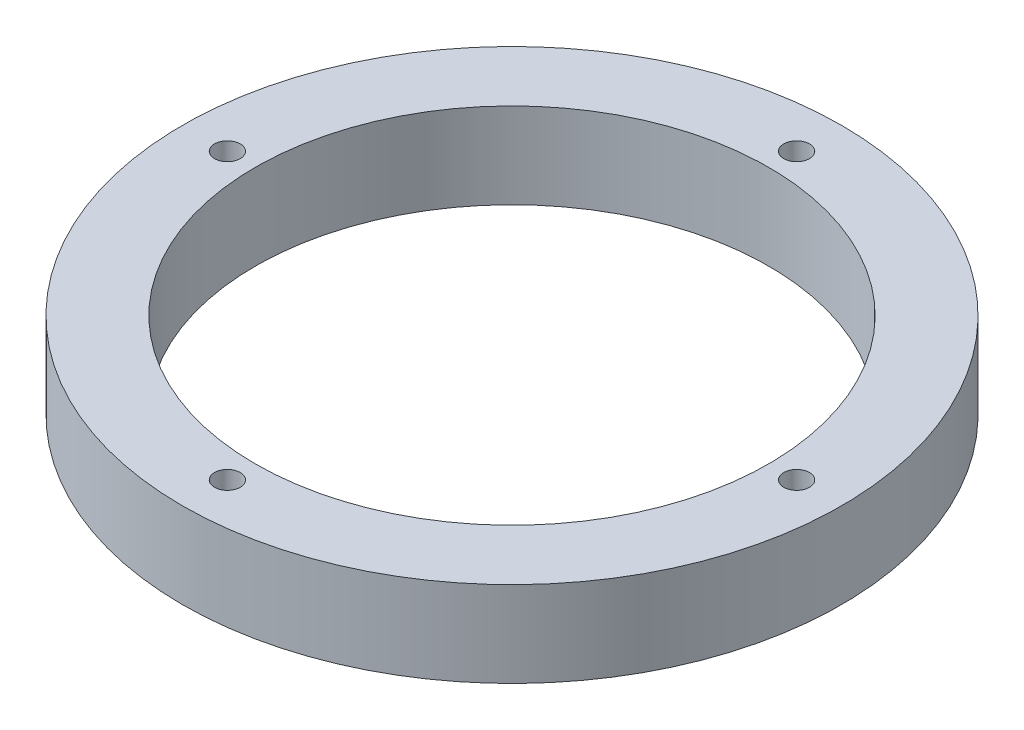
ISO-10303-21;
HEADER;
FILE_DESCRIPTION(('STEP AP214'),'2;1');
FILE_NAME('part.step','',(''),(''),'','','');
FILE_SCHEMA(('AUTOMOTIVE_DESIGN { 1 0 10303 214 1 1 1 1 }'));
ENDSEC;
DATA;
#1=APPLICATION_CONTEXT('core data for automotive mechanical design processes');
#2=APPLICATION_PROTOCOL_DEFINITION('international standard','automotive_design',2000,#1);
#3=PRODUCT_CONTEXT('',#1,'mechanical');
#4=PRODUCT('Part','Part','',(#3));
#5=PRODUCT_RELATED_PRODUCT_CATEGORY('part','',(#4));
#6=PRODUCT_DEFINITION_FORMATION('','',#4);
#7=PRODUCT_DEFINITION_CONTEXT('part definition',#1,'design');
#8=PRODUCT_DEFINITION('design','',#6,#7);
#9=PRODUCT_DEFINITION_SHAPE('','',#8);
#10=(LENGTH_UNIT() NAMED_UNIT(*) SI_UNIT(.MILLI.,.METRE.));
#11=(NAMED_UNIT(*) PLANE_ANGLE_UNIT() SI_UNIT($,.RADIAN.));
#12=(NAMED_UNIT(*) SI_UNIT($,.STERADIAN.) SOLID_ANGLE_UNIT());
#13=UNCERTAINTY_MEASURE_WITH_UNIT(LENGTH_MEASURE(1.E-05),#10,'distance_accuracy_value','');
#14=(GEOMETRIC_REPRESENTATION_CONTEXT(3) GLOBAL_UNCERTAINTY_ASSIGNED_CONTEXT((#13)) GLOBAL_UNIT_ASSIGNED_CONTEXT((#10,
#11,#12)) REPRESENTATION_CONTEXT('',''));
#15=CARTESIAN_POINT('',(0.,0.,0.));
#16=DIRECTION('',(0.,0.,1.));
#17=DIRECTION('',(1.,0.,0.));
#18=AXIS2_PLACEMENT_3D('',#15,#16,#17);
#19=CARTESIAN_POINT('',(0.,12.7,0.));
#20=DIRECTION('',(0.,1.,0.));
#21=DIRECTION('',(0.,0.,1.));
#22=AXIS2_PLACEMENT_3D('',#19,#20,#21);
#23=PLANE('',#22);
#24=CARTESIAN_POINT('',(1.32583864945278E-12,12.7,42.2275));
#25=DIRECTION('',(0.,1.,0.));
#26=DIRECTION('',(0.,0.,1.));
#27=AXIS2_PLACEMENT_3D('',#24,#25,#26);
#28=CIRCLE('',#27,1.905);
#29=CARTESIAN_POINT('',(1.32583864945278E-12,12.7,44.1325));
#30=VERTEX_POINT('',#29);
#31=EDGE_CURVE('E60',#30,#30,#28,.T.);
#32=ORIENTED_EDGE('',*,*,#31,.F.);
#33=EDGE_LOOP('',(#32));
#34=FACE_BOUND('',#33,.T.);
#35=CARTESIAN_POINT('',(0.,12.7,-42.2275));
#36=DIRECTION('',(0.,1.,0.));
#37=DIRECTION('',(0.,0.,1.));
#38=AXIS2_PLACEMENT_3D('',#35,#36,#37);
#39=CIRCLE('',#38,1.905);
#40=CARTESIAN_POINT('',(0.,12.7,-40.3225));
#41=VERTEX_POINT('',#40);
#42=EDGE_CURVE('E48',#41,#41,#39,.T.);
#43=ORIENTED_EDGE('',*,*,#42,.F.);
#44=EDGE_LOOP('',(#43));
#45=FACE_BOUND('',#44,.T.);
#46=CARTESIAN_POINT('',(0.,12.7,0.));
#47=DIRECTION('',(0.,1.,0.));
#48=DIRECTION('',(0.,0.,1.));
#49=AXIS2_PLACEMENT_3D('',#46,#47,#48);
#50=CIRCLE('',#49,48.895);
#51=CARTESIAN_POINT('',(0.,12.7,48.895));
#52=VERTEX_POINT('',#51);
#53=EDGE_CURVE('E10',#52,#52,#50,.T.);
#54=ORIENTED_EDGE('',*,*,#53,.T.);
#55=EDGE_LOOP('',(#54));
#56=FACE_BOUND('',#55,.T.);
#57=CARTESIAN_POINT('',(0.,12.7,0.));
#58=DIRECTION('',(0.,1.,0.));
#59=DIRECTION('',(0.,0.,1.));
#60=AXIS2_PLACEMENT_3D('',#57,#58,#59);
#61=CIRCLE('',#60,38.1);
#62=CARTESIAN_POINT('',(0.,12.7,38.1));
#63=VERTEX_POINT('',#62);
#64=EDGE_CURVE('E43',#63,#63,#61,.T.);
#65=ORIENTED_EDGE('',*,*,#64,.F.);
#66=EDGE_LOOP('',(#65));
#67=FACE_BOUND('',#66,.T.);
#68=CARTESIAN_POINT('',(42.2275000000007,12.7,-6.62919324726392E-13));
#69=DIRECTION('',(0.,1.,0.));
#70=DIRECTION('',(0.,0.,1.));
#71=AXIS2_PLACEMENT_3D('',#68,#69,#70);
#72=CIRCLE('',#71,1.905);
#73=CARTESIAN_POINT('',(42.2275000000007,12.7,1.90499999999934));
#74=VERTEX_POINT('',#73);
#75=EDGE_CURVE('E54',#74,#74,#72,.T.);
#76=ORIENTED_EDGE('',*,*,#75,.F.);
#77=EDGE_LOOP('',(#76));
#78=FACE_BOUND('',#77,.T.);
#79=CARTESIAN_POINT('',(-42.2274999999993,12.7,6.68090701997492E-13));
#80=DIRECTION('',(0.,1.,0.));
#81=DIRECTION('',(0.,0.,1.));
#82=AXIS2_PLACEMENT_3D('',#79,#80,#81);
#83=CIRCLE('',#82,1.905);
#84=CARTESIAN_POINT('',(-42.2274999999993,12.7,1.90500000000067));
#85=VERTEX_POINT('',#84);
#86=EDGE_CURVE('E66',#85,#85,#83,.T.);
#87=ORIENTED_EDGE('',*,*,#86,.F.);
#88=EDGE_LOOP('',(#87));
#89=FACE_BOUND('',#88,.T.);
#90=ADVANCED_FACE('F32',(#34,#45,#56,#67,#78,#89),#23,.T.);
#91=CARTESIAN_POINT('',(0.,0.,0.));
#92=DIRECTION('',(0.,1.,0.));
#93=DIRECTION('',(0.,0.,1.));
#94=AXIS2_PLACEMENT_3D('',#91,#92,#93);
#95=PLANE('',#94);
#96=CARTESIAN_POINT('',(0.,0.,0.));
#97=DIRECTION('',(0.,1.,0.));
#98=DIRECTION('',(0.,0.,1.));
#99=AXIS2_PLACEMENT_3D('',#96,#97,#98);
#100=CIRCLE('',#99,48.895);
#101=CARTESIAN_POINT('',(0.,0.,48.895));
#102=VERTEX_POINT('',#101);
#103=EDGE_CURVE('E36',#102,#102,#100,.T.);
#104=ORIENTED_EDGE('',*,*,#103,.F.);
#105=EDGE_LOOP('',(#104));
#106=FACE_BOUND('',#105,.T.);
#107=CARTESIAN_POINT('',(0.,0.,0.));
#108=DIRECTION('',(0.,1.,0.));
#109=DIRECTION('',(0.,0.,1.));
#110=AXIS2_PLACEMENT_3D('',#107,#108,#109);
#111=CIRCLE('',#110,38.1);
#112=CARTESIAN_POINT('',(0.,0.,38.1));
#113=VERTEX_POINT('',#112);
#114=EDGE_CURVE('E45',#113,#113,#111,.T.);
#115=ORIENTED_EDGE('',*,*,#114,.T.);
#116=EDGE_LOOP('',(#115));
#117=FACE_BOUND('',#116,.T.);
#118=CARTESIAN_POINT('',(0.,0.,-42.2275));
#119=DIRECTION('',(0.,1.,0.));
#120=DIRECTION('',(0.,0.,1.));
#121=AXIS2_PLACEMENT_3D('',#118,#119,#120);
#122=CIRCLE('',#121,1.905);
#123=CARTESIAN_POINT('',(0.,0.,-40.3225));
#124=VERTEX_POINT('',#123);
#125=EDGE_CURVE('E51',#124,#124,#122,.T.);
#126=ORIENTED_EDGE('',*,*,#125,.T.);
#127=EDGE_LOOP('',(#126));
#128=FACE_BOUND('',#127,.T.);
#129=CARTESIAN_POINT('',(42.2275000000007,0.,-6.62919324726392E-13));
#130=DIRECTION('',(0.,1.,0.));
#131=DIRECTION('',(0.,0.,1.));
#132=AXIS2_PLACEMENT_3D('',#129,#130,#131);
#133=CIRCLE('',#132,1.905);
#134=CARTESIAN_POINT('',(42.2275000000007,0.,1.90499999999934));
#135=VERTEX_POINT('',#134);
#136=EDGE_CURVE('E57',#135,#135,#133,.T.);
#137=ORIENTED_EDGE('',*,*,#136,.T.);
#138=EDGE_LOOP('',(#137));
#139=FACE_BOUND('',#138,.T.);
#140=CARTESIAN_POINT('',(1.32583864945278E-12,0.,42.2275));
#141=DIRECTION('',(0.,1.,0.));
#142=DIRECTION('',(0.,0.,1.));
#143=AXIS2_PLACEMENT_3D('',#140,#141,#142);
#144=CIRCLE('',#143,1.905);
#145=CARTESIAN_POINT('',(1.32583864945278E-12,0.,44.1325));
#146=VERTEX_POINT('',#145);
#147=EDGE_CURVE('E63',#146,#146,#144,.T.);
#148=ORIENTED_EDGE('',*,*,#147,.T.);
#149=EDGE_LOOP('',(#148));
#150=FACE_BOUND('',#149,.T.);
#151=CARTESIAN_POINT('',(-42.2274999999993,0.,6.68090701997492E-13));
#152=DIRECTION('',(0.,1.,0.));
#153=DIRECTION('',(0.,0.,1.));
#154=AXIS2_PLACEMENT_3D('',#151,#152,#153);
#155=CIRCLE('',#154,1.905);
#156=CARTESIAN_POINT('',(-42.2274999999993,0.,1.90500000000067));
#157=VERTEX_POINT('',#156);
#158=EDGE_CURVE('E69',#157,#157,#155,.T.);
#159=ORIENTED_EDGE('',*,*,#158,.T.);
#160=EDGE_LOOP('',(#159));
#161=FACE_BOUND('',#160,.T.);
#162=ADVANCED_FACE('F79',(#106,#117,#128,#139,#150,#161),#95,.F.);
#163=CARTESIAN_POINT('',(0.,12.7,0.));
#164=DIRECTION('',(0.,-1.,0.));
#165=DIRECTION('',(0.,0.,-1.));
#166=AXIS2_PLACEMENT_3D('',#163,#164,#165);
#167=CYLINDRICAL_SURFACE('',#166,48.895);
#168=ORIENTED_EDGE('',*,*,#53,.F.);
#169=EDGE_LOOP('',(#168));
#170=FACE_BOUND('',#169,.T.);
#171=ORIENTED_EDGE('',*,*,#103,.T.);
#172=EDGE_LOOP('',(#171));
#173=FACE_BOUND('',#172,.T.);
#174=ADVANCED_FACE('F34',(#170,#173),#167,.T.);
#175=CARTESIAN_POINT('',(0.,12.7,0.));
#176=DIRECTION('',(0.,-1.,0.));
#177=DIRECTION('',(0.,0.,-1.));
#178=AXIS2_PLACEMENT_3D('',#175,#176,#177);
#179=CYLINDRICAL_SURFACE('',#178,38.1);
#180=ORIENTED_EDGE('',*,*,#64,.T.);
#181=EDGE_LOOP('',(#180));
#182=FACE_BOUND('',#181,.T.);
#183=ORIENTED_EDGE('',*,*,#114,.F.);
#184=EDGE_LOOP('',(#183));
#185=FACE_BOUND('',#184,.T.);
#186=ADVANCED_FACE('F89',(#182,#185),#179,.F.);
#187=CARTESIAN_POINT('',(0.,12.7,-42.2275));
#188=DIRECTION('',(0.,-1.,0.));
#189=DIRECTION('',(0.,0.,-1.));
#190=AXIS2_PLACEMENT_3D('',#187,#188,#189);
#191=CYLINDRICAL_SURFACE('',#190,1.905);
#192=ORIENTED_EDGE('',*,*,#42,.T.);
#193=EDGE_LOOP('',(#192));
#194=FACE_BOUND('',#193,.T.);
#195=ORIENTED_EDGE('',*,*,#125,.F.);
#196=EDGE_LOOP('',(#195));
#197=FACE_BOUND('',#196,.T.);
#198=ADVANCED_FACE('F92',(#194,#197),#191,.F.);
#199=CARTESIAN_POINT('',(42.2275000000007,12.7,-6.62919324726392E-13));
#200=DIRECTION('',(0.,-1.,0.));
#201=DIRECTION('',(0.,0.,-1.));
#202=AXIS2_PLACEMENT_3D('',#199,#200,#201);
#203=CYLINDRICAL_SURFACE('',#202,1.905);
#204=ORIENTED_EDGE('',*,*,#75,.T.);
#205=EDGE_LOOP('',(#204));
#206=FACE_BOUND('',#205,.T.);
#207=ORIENTED_EDGE('',*,*,#136,.F.);
#208=EDGE_LOOP('',(#207));
#209=FACE_BOUND('',#208,.T.);
#210=ADVANCED_FACE('F96',(#206,#209),#203,.F.);
#211=CARTESIAN_POINT('',(1.32583864945278E-12,12.7,42.2275));
#212=DIRECTION('',(0.,-1.,0.));
#213=DIRECTION('',(0.,0.,-1.));
#214=AXIS2_PLACEMENT_3D('',#211,#212,#213);
#215=CYLINDRICAL_SURFACE('',#214,1.905);
#216=ORIENTED_EDGE('',*,*,#31,.T.);
#217=EDGE_LOOP('',(#216));
#218=FACE_BOUND('',#217,.T.);
#219=ORIENTED_EDGE('',*,*,#147,.F.);
#220=EDGE_LOOP('',(#219));
#221=FACE_BOUND('',#220,.T.);
#222=ADVANCED_FACE('F100',(#218,#221),#215,.F.);
#223=CARTESIAN_POINT('',(-42.2274999999993,12.7,6.68090701997492E-13));
#224=DIRECTION('',(0.,-1.,0.));
#225=DIRECTION('',(0.,0.,-1.));
#226=AXIS2_PLACEMENT_3D('',#223,#224,#225);
#227=CYLINDRICAL_SURFACE('',#226,1.905);
#228=ORIENTED_EDGE('',*,*,#86,.T.);
#229=EDGE_LOOP('',(#228));
#230=FACE_BOUND('',#229,.T.);
#231=ORIENTED_EDGE('',*,*,#158,.F.);
#232=EDGE_LOOP('',(#231));
#233=FACE_BOUND('',#232,.T.);
#234=ADVANCED_FACE('F75',(#230,#233),#227,.F.);
#235=CLOSED_SHELL('',(#90,#162,#174,#186,#198,#210,#222,#234));
#236=MANIFOLD_SOLID_BREP('B2',#235);
#237=ADVANCED_BREP_SHAPE_REPRESENTATION('',(#18,#236),#14);
#238=SHAPE_DEFINITION_REPRESENTATION(#9,#237);
ENDSEC;
END-ISO-10303-21;
